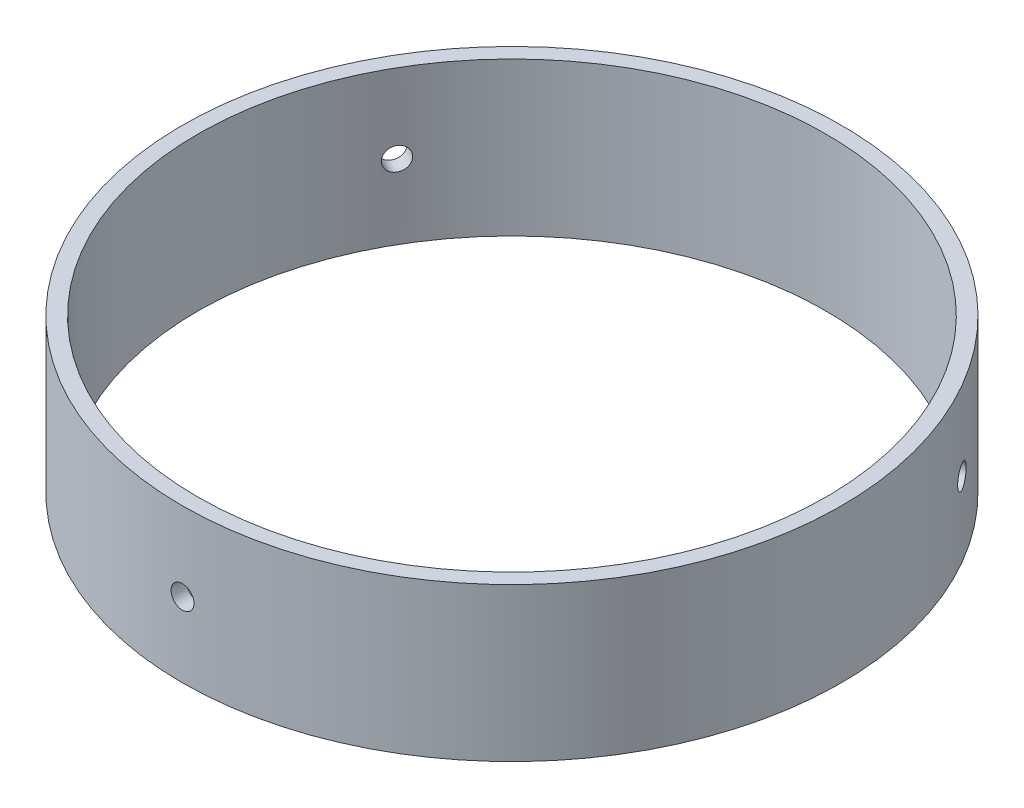
ISO-10303-21;
HEADER;
FILE_DESCRIPTION(('STEP AP214'),'2;1');
FILE_NAME('part.step','',(''),(''),'','','');
FILE_SCHEMA(('AUTOMOTIVE_DESIGN { 1 0 10303 214 1 1 1 1 }'));
ENDSEC;
DATA;
#1=APPLICATION_CONTEXT('core data for automotive mechanical design processes');
#2=APPLICATION_PROTOCOL_DEFINITION('international standard','automotive_design',2000,#1);
#3=PRODUCT_CONTEXT('',#1,'mechanical');
#4=PRODUCT('Part','Part','',(#3));
#5=PRODUCT_RELATED_PRODUCT_CATEGORY('part','',(#4));
#6=PRODUCT_DEFINITION_FORMATION('','',#4);
#7=PRODUCT_DEFINITION_CONTEXT('part definition',#1,'design');
#8=PRODUCT_DEFINITION('design','',#6,#7);
#9=PRODUCT_DEFINITION_SHAPE('','',#8);
#10=(LENGTH_UNIT() NAMED_UNIT(*) SI_UNIT(.MILLI.,.METRE.));
#11=(NAMED_UNIT(*) PLANE_ANGLE_UNIT() SI_UNIT($,.RADIAN.));
#12=(NAMED_UNIT(*) SI_UNIT($,.STERADIAN.) SOLID_ANGLE_UNIT());
#13=UNCERTAINTY_MEASURE_WITH_UNIT(LENGTH_MEASURE(1.E-05),#10,'distance_accuracy_value','');
#14=(GEOMETRIC_REPRESENTATION_CONTEXT(3) GLOBAL_UNCERTAINTY_ASSIGNED_CONTEXT((#13)) GLOBAL_UNIT_ASSIGNED_CONTEXT((#10,
#11,#12)) REPRESENTATION_CONTEXT('',''));
#15=CARTESIAN_POINT('',(0.,0.,0.));
#16=DIRECTION('',(0.,0.,1.));
#17=DIRECTION('',(1.,0.,0.));
#18=AXIS2_PLACEMENT_3D('',#15,#16,#17);
#19=CARTESIAN_POINT('',(0.,25.4,0.));
#20=DIRECTION('',(0.,-1.,0.));
#21=DIRECTION('',(0.,0.,-1.));
#22=AXIS2_PLACEMENT_3D('',#19,#20,#21);
#23=CYLINDRICAL_SURFACE('',#22,54.61);
#24=CARTESIAN_POINT('',(0.,25.4,0.));
#25=DIRECTION('',(0.,1.,0.));
#26=DIRECTION('',(0.,0.,1.));
#27=AXIS2_PLACEMENT_3D('',#24,#25,#26);
#28=CIRCLE('',#27,54.61);
#29=CARTESIAN_POINT('',(0.,25.4,54.61));
#30=VERTEX_POINT('',#29);
#31=EDGE_CURVE('E10',#30,#30,#28,.T.);
#32=ORIENTED_EDGE('',*,*,#31,.F.);
#33=EDGE_LOOP('',(#32));
#34=FACE_BOUND('',#33,.T.);
#35=CARTESIAN_POINT('',(0.,0.,0.));
#36=DIRECTION('',(0.,1.,0.));
#37=DIRECTION('',(0.,0.,1.));
#38=AXIS2_PLACEMENT_3D('',#35,#36,#37);
#39=CIRCLE('',#38,54.61);
#40=CARTESIAN_POINT('',(0.,0.,54.61));
#41=VERTEX_POINT('',#40);
#42=EDGE_CURVE('E44',#41,#41,#39,.T.);
#43=ORIENTED_EDGE('',*,*,#42,.T.);
#44=EDGE_LOOP('',(#43));
#45=FACE_BOUND('',#44,.T.);
#46=CARTESIAN_POINT('',(0.,10.4239555269859,54.61));
#47=CARTESIAN_POINT('',(0.106969775627343,10.4239602599121,54.6099995529571));
#48=CARTESIAN_POINT('',(0.214016285777394,10.4329956416153,54.6096823316829));
#49=CARTESIAN_POINT('',(0.425158795307455,10.4689128482885,54.608447368905));
#50=CARTESIAN_POINT('',(0.52925112556797,10.4958159334483,54.6075289120296));
#51=CARTESIAN_POINT('',(0.731395950473661,10.5666995988189,54.6051954791821));
#52=CARTESIAN_POINT('',(0.829451396653879,10.6106717556031,54.6037807481497));
#53=CARTESIAN_POINT('',(1.01676171214993,10.7144330998902,54.6006142968803));
#54=CARTESIAN_POINT('',(1.10601870854792,10.7742184515143,54.5988626583965));
#55=CARTESIAN_POINT('',(1.27327623468102,10.9079480611374,54.595218479672));
#56=CARTESIAN_POINT('',(1.35127129184676,10.981899162431,54.5933258716019));
#57=CARTESIAN_POINT('',(1.49374470053449,11.1418485181315,54.5896136565972));
#58=CARTESIAN_POINT('',(1.55822251103852,11.2278472545065,54.5877940525868));
#59=CARTESIAN_POINT('',(1.67184201742921,11.4094739988082,54.5844326497573));
#60=CARTESIAN_POINT('',(1.72098007826895,11.5051042820239,54.5828909168215));
#61=CARTESIAN_POINT('',(1.80250171780979,11.7032633842901,54.580259807431));
#62=CARTESIAN_POINT('',(1.83488537555516,11.8057921707921,54.5791704288421));
#63=CARTESIAN_POINT('',(1.88196623483984,12.0147933143339,54.5775674030549));
#64=CARTESIAN_POINT('',(1.89667068923612,12.1212640357115,54.5770535197666));
#65=CARTESIAN_POINT('',(1.90799809069456,12.3351638303227,54.5766587189544));
#66=CARTESIAN_POINT('',(1.90462112389026,12.4425928989887,54.5767777984151));
#67=CARTESIAN_POINT('',(1.87988764209952,12.6553106574942,54.577635275006));
#68=CARTESIAN_POINT('',(1.85853896320751,12.7606002597038,54.5783734022162));
#69=CARTESIAN_POINT('',(1.79848019551148,12.9661002369379,54.5803853434239));
#70=CARTESIAN_POINT('',(1.75977006150685,13.0663105987378,54.5816591588161));
#71=CARTESIAN_POINT('',(1.66607823603268,13.2588327254405,54.5845991971315));
#72=CARTESIAN_POINT('',(1.6110929564523,13.3511427427972,54.5862655065696));
#73=CARTESIAN_POINT('',(1.48641432024243,13.5252246823535,54.5898026067403));
#74=CARTESIAN_POINT('',(1.4167209160937,13.606996570505,54.5916733981335));
#75=CARTESIAN_POINT('',(1.26456006729128,13.7577266844407,54.5954097769148));
#76=CARTESIAN_POINT('',(1.18208583036259,13.8266780537461,54.5972753609957));
#77=CARTESIAN_POINT('',(1.00672840008933,13.9497570524933,54.6007900626657));
#78=CARTESIAN_POINT('',(0.913845204914098,14.003884679328,54.6024391802168));
#79=CARTESIAN_POINT('',(0.720302624519637,14.0957789618525,54.6053350891605));
#80=CARTESIAN_POINT('',(0.61964313459512,14.1335453971989,54.6065818751347));
#81=CARTESIAN_POINT('',(0.4134070526955,14.1916408455937,54.6085324969699));
#82=CARTESIAN_POINT('',(0.307830478743623,14.2119699225522,54.609236334821));
#83=CARTESIAN_POINT('',(0.0948167356045886,14.2346051735236,54.610021469043));
#84=CARTESIAN_POINT('',(-0.0126194243657498,14.2369208341309,54.6101030930966));
#85=CARTESIAN_POINT('',(-0.226354938776963,14.2234882479484,54.6096354675401));
#86=CARTESIAN_POINT('',(-0.332654295017761,14.2077400297638,54.6090862189291));
#87=CARTESIAN_POINT('',(-0.541072271659497,14.1586345722743,54.6074189526073));
#88=CARTESIAN_POINT('',(-0.643191909265567,14.1252816451613,54.606301074182));
#89=CARTESIAN_POINT('',(-0.840382893964743,14.0419179126559,54.6036224941728));
#90=CARTESIAN_POINT('',(-0.935454221633547,13.9919070613582,54.6020617913684));
#91=CARTESIAN_POINT('',(-1.11589350123285,13.876622705868,54.5986725126272));
#92=CARTESIAN_POINT('',(-1.20125737498798,13.8113428219848,54.5968438248408));
#93=CARTESIAN_POINT('',(-1.35981760983991,13.6673828168347,54.5931250135553));
#94=CARTESIAN_POINT('',(-1.43301393058506,13.5887026511297,54.5912348898524));
#95=CARTESIAN_POINT('',(-1.56519301489747,13.4201348402539,54.5876053454446));
#96=CARTESIAN_POINT('',(-1.62416965425449,13.3302423913148,54.5858659898791));
#97=CARTESIAN_POINT('',(-1.72619338466828,13.1418261826704,54.5827351164865));
#98=CARTESIAN_POINT('',(-1.76924051827669,13.0433024460222,54.5813435977301));
#99=CARTESIAN_POINT('',(-1.83817256143816,12.8404433737013,54.5790657587231));
#100=CARTESIAN_POINT('',(-1.86406142183157,12.7361093818919,54.5781793221794));
#101=CARTESIAN_POINT('',(-1.89795497261171,12.524572480879,54.5770112674852));
#102=CARTESIAN_POINT('',(-1.90595969567723,12.417369576918,54.5767296482294));
#103=CARTESIAN_POINT('',(-1.9038573014907,12.2031991246086,54.5768030222639));
#104=CARTESIAN_POINT('',(-1.89375983430056,12.0962314812794,54.5771576763645));
#105=CARTESIAN_POINT('',(-1.85575956396343,11.8855107461099,54.5784629040581));
#106=CARTESIAN_POINT('',(-1.82785672574385,11.7817576606022,54.579413478825));
#107=CARTESIAN_POINT('',(-1.75503933669187,11.5804081229601,54.58180333285));
#108=CARTESIAN_POINT('',(-1.7101245230023,11.4828117659826,54.5832426196594));
#109=CARTESIAN_POINT('',(-1.6045608055315,11.2965463414836,54.5864475932976));
#110=CARTESIAN_POINT('',(-1.54391245361031,11.2078769609965,54.5882132686775));
#111=CARTESIAN_POINT('',(-1.40857232251474,11.0419365764004,54.5918729816849));
#112=CARTESIAN_POINT('',(-1.33387456925283,10.9646704462181,54.5937670736977));
#113=CARTESIAN_POINT('',(-1.17254589656414,10.8237534674585,54.5974700126265));
#114=CARTESIAN_POINT('',(-1.08591203075166,10.7601059905303,54.5992788383464));
#115=CARTESIAN_POINT('',(-0.903129764902133,10.6482185131034,54.6026081084077));
#116=CARTESIAN_POINT('',(-0.806974662675166,10.5999894683916,54.6041283473794));
#117=CARTESIAN_POINT('',(-0.608000477464156,10.5204160522017,54.6067055723962));
#118=CARTESIAN_POINT('',(-0.505189490476256,10.4890515840214,54.6077631095393));
#119=CARTESIAN_POINT('',(-0.334775953220498,10.4523927368054,54.6090137044382));
#120=CARTESIAN_POINT('',(-0.268279082846069,10.4417422400079,54.6093819563875));
#121=CARTESIAN_POINT('',(-0.134531593647159,10.4275221480815,54.6098752447082));
#122=CARTESIAN_POINT('',(-0.0672809751254226,10.4239525501087,54.6100002811774));
#123=CARTESIAN_POINT('',(0.,10.4239555269859,54.61));
#124=B_SPLINE_CURVE_WITH_KNOTS('',3,(#46,#47,#48,#49,#50,#51,#52,#53,#54,#55,#56,#57,#58,#59,
#60,#61,#62,#63,#64,#65,#66,#67,#68,#69,#70,#71,#72,#73,#74,#75,#76,#77,#78,#79,#80,#81,#82,#83,
#84,#85,#86,#87,#88,#89,#90,#91,#92,#93,#94,#95,#96,#97,#98,#99,#100,#101,#102,#103,#104,#105,
#106,#107,#108,#109,#110,#111,#112,#113,#114,#115,#116,#117,#118,#119,#120,#121,#122,#123),
.UNSPECIFIED.,.T.,.F.,(4,2,2,2,2,2,2,2,2,2,2,2,2,2,2,2,2,2,2,2,2,2,2,2,2,2,2,2,2,2,2,2,2,2,2,2,
2,2,4),(0.,0.320663739375775,0.641709711141668,0.962597450739142,1.28340742240517,
1.60437276595062,1.92535095344858,2.2464051452273,2.5674578223161,2.88837874321022,
3.2092981353511,3.53007767142806,3.85085804266061,4.17170918769463,4.49256136935549,
4.81358465392159,5.13460799494749,5.45563565920209,5.77666214684486,6.09751955748752,
6.41837646003512,6.73915480661652,7.05993403719196,7.38084753556984,7.70176209818219,
8.02281462813049,8.34386630046197,8.66484402217062,8.98582115737217,9.30662723436537,
9.62743394327668,9.94824560927158,10.2690460241921,10.5899831595582,10.9109996594955,
11.2322437578877,11.5531041919902,11.7547927307502,11.9564811885042),.UNSPECIFIED.);
#125=CARTESIAN_POINT('',(0.,10.4239555269859,54.61));
#126=VERTEX_POINT('',#125);
#127=EDGE_CURVE('E61',#126,#126,#124,.T.);
#128=ORIENTED_EDGE('',*,*,#127,.F.);
#129=EDGE_LOOP('',(#128));
#130=FACE_BOUND('',#129,.T.);
#131=CARTESIAN_POINT('',(-46.3123633368386,12.3289555269859,-28.9381599649434));
#132=CARTESIAN_POINT('',(-46.3123660913571,12.2219857736902,-28.9381560901295));
#133=CARTESIAN_POINT('',(-46.3171586737822,12.1149392857948,-28.9304899329744));
#134=CARTESIAN_POINT('',(-46.3361873915337,11.903796822506,-28.9000025686463));
#135=CARTESIAN_POINT('',(-46.3504347768465,11.7997045162496,-28.8771633074162));
#136=CARTESIAN_POINT('',(-46.3878983630238,11.5975597420818,-28.8169435532089));
#137=CARTESIAN_POINT('',(-46.4111101397108,11.4995043224321,-28.7795702331323));
#138=CARTESIAN_POINT('',(-46.465733894339,11.3121940513111,-28.6912940572423));
#139=CARTESIAN_POINT('',(-46.4971438836076,11.2229370727913,-28.6403944824913));
#140=CARTESIAN_POINT('',(-46.5671650456343,11.0556795261527,-28.5264036044287));
#141=CARTESIAN_POINT('',(-46.6057797022843,10.9776844363421,-28.4633064022923));
#142=CARTESIAN_POINT('',(-46.6889690422995,10.8352109647398,-28.3266421510839));
#143=CARTESIAN_POINT('',(-46.733543964059,10.770733123866,-28.2530746832223));
#144=CARTESIAN_POINT('',(-46.8272676316227,10.6571135859649,-28.0974615480495));
#145=CARTESIAN_POINT('',(-46.8764174562864,10.6079755183377,-28.0154138804205));
#146=CARTESIAN_POINT('',(-46.9777746240633,10.5264538644789,-27.8451180625097));
#147=CARTESIAN_POINT('',(-47.0299819527656,10.4940701992857,-27.7568699414522));
#148=CARTESIAN_POINT('',(-47.1358700127583,10.4469893240714,-27.5766707333841));
#149=CARTESIAN_POINT('',(-47.189550130544,10.4322848606674,-27.4847211810018));
#150=CARTESIAN_POINT('',(-47.2968417154731,10.4209574362557,-27.2996758305652));
#151=CARTESIAN_POINT('',(-47.350453182942,10.4243343892091,-27.2065800379672));
#152=CARTESIAN_POINT('',(-47.4560699366224,10.4490678493385,-27.0219325175027));
#153=CARTESIAN_POINT('',(-47.5080759114141,10.4704165343554,-26.9303801355504));
#154=CARTESIAN_POINT('',(-47.6090844714665,10.5304753399644,-26.7514063538986));
#155=CARTESIAN_POINT('',(-47.658087048931,10.5691855056209,-26.6639849649222));
#156=CARTESIAN_POINT('',(-47.751802960256,10.6628773960766,-26.4957863705539));
#157=CARTESIAN_POINT('',(-47.796515347378,10.7178627015099,-26.4150106322502));
#158=CARTESIAN_POINT('',(-47.8804937092033,10.8425413926011,-26.2624830248397));
#159=CARTESIAN_POINT('',(-47.9197596663034,10.912234825795,-26.1907311848989));
#160=CARTESIAN_POINT('',(-47.9918888889853,11.0643956948733,-26.0583269063547));
#161=CARTESIAN_POINT('',(-48.0247487319519,11.1468699171875,-25.9976804020793));
#162=CARTESIAN_POINT('',(-48.0832437511496,11.3222273060587,-25.8893332032505));
#163=CARTESIAN_POINT('',(-48.1088789260766,11.4151104744946,-25.8416325110341));
#164=CARTESIAN_POINT('',(-48.1523171628703,11.608653048347,-25.7606012344697));
#165=CARTESIAN_POINT('',(-48.1701201150402,11.7093125626544,-25.7272708513901));
#166=CARTESIAN_POINT('',(-48.1974776703859,11.9155486974469,-25.6759829082973));
#167=CARTESIAN_POINT('',(-48.2070323038607,12.0211252998681,-25.6580252918143));
#168=CARTESIAN_POINT('',(-48.21766956438,12.2341390551277,-25.6380298159411));
#169=CARTESIAN_POINT('',(-48.2187566544276,12.3415751979225,-25.6359835701175));
#170=CARTESIAN_POINT('',(-48.2124455704041,12.5553106744224,-25.6478505054612));
#171=CARTESIAN_POINT('',(-48.205047409769,12.6616100099274,-25.6617636613574));
#172=CARTESIAN_POINT('',(-48.1819393635332,12.8700278890938,-25.7051243188035));
#173=CARTESIAN_POINT('',(-48.1662315174368,12.9721474520031,-25.7345680085804));
#174=CARTESIAN_POINT('',(-48.1268703840616,13.1693382965146,-25.8081029175792));
#175=CARTESIAN_POINT('',(-48.1032170748293,13.2644095586412,-25.8521941772726));
#176=CARTESIAN_POINT('',(-48.0485108805233,13.4448487953177,-25.9537283720832));
#177=CARTESIAN_POINT('',(-48.0174548967366,13.5302126842602,-26.0111768982201));
#178=CARTESIAN_POINT('',(-47.9486956726979,13.6887729539363,-26.1377094263594));
#179=CARTESIAN_POINT('',(-47.9109924104376,13.7619692943828,-26.2067934668859));
#180=CARTESIAN_POINT('',(-47.8298513229897,13.8941484188016,-26.3545919905116));
#181=CARTESIAN_POINT('',(-47.7864110393656,13.9531250785476,-26.4333106011651));
#182=CARTESIAN_POINT('',(-47.6949134386751,14.0551488447892,-26.5980487621689));
#183=CARTESIAN_POINT('',(-47.6468561339423,14.0981959938366,-26.6840682930159));
#184=CARTESIAN_POINT('',(-47.5473983190996,14.1671280477679,-26.8608877638713));
#185=CARTESIAN_POINT('',(-47.4959985829182,14.1930169101651,-26.9516865963278));
#186=CARTESIAN_POINT('',(-47.3912411432713,14.2269104745093,-27.1354665654455));
#187=CARTESIAN_POINT('',(-47.3378834433675,14.2349152089862,-27.228447698137));
#188=CARTESIAN_POINT('',(-47.2307347022331,14.2328128470289,-27.413888105106));
#189=CARTESIAN_POINT('',(-47.1769439067305,14.2227153871055,-27.5063476307729));
#190=CARTESIAN_POINT('',(-47.0704537692282,14.1847151127926,-27.6881849907666));
#191=CARTESIAN_POINT('',(-47.0177544293729,14.1568122634248,-27.777562819039));
#192=CARTESIAN_POINT('',(-46.9150108998429,14.0839948327912,-27.9507423553223));
#193=CARTESIAN_POINT('',(-46.8649667512001,14.0390799887192,-28.0345439771668));
#194=CARTESIAN_POINT('',(-46.7690592712337,13.9335161948645,-28.1942526561914));
#195=CARTESIAN_POINT('',(-46.7231957933335,13.8728677969964,-28.2701599901631));
#196=CARTESIAN_POINT('',(-46.6370565859178,13.7375276165402,-28.4120389412052));
#197=CARTESIAN_POINT('',(-46.5967832419654,13.6628298702866,-28.478006317467));
#198=CARTESIAN_POINT('',(-46.523117685507,13.5015012256606,-28.5981923231773));
#199=CARTESIAN_POINT('',(-46.4897271771445,13.4148673808282,-28.6524080431662));
#200=CARTESIAN_POINT('',(-46.4308994255775,13.2320851308644,-28.7476403172151));
#201=CARTESIAN_POINT('',(-46.4054678411262,13.1359300198159,-28.7886474806635));
#202=CARTESIAN_POINT('',(-46.3634482161624,12.9369558156681,-28.8562708869922));
#203=CARTESIAN_POINT('',(-46.3468496499529,12.8341448186132,-28.8829042586646));
#204=CARTESIAN_POINT('',(-46.3274365911964,12.6637313045444,-28.9140260855593));
#205=CARTESIAN_POINT('',(-46.3217922458428,12.5972344691983,-28.923065442606));
#206=CARTESIAN_POINT('',(-46.3142547531617,12.4634870502329,-28.9351335996626));
#207=CARTESIAN_POINT('',(-46.3123616043245,12.3962364669169,-28.9381624020914));
#208=CARTESIAN_POINT('',(-46.3123633368386,12.3289555269859,-28.9381599649434));
#209=B_SPLINE_CURVE_WITH_KNOTS('',3,(#131,#132,#133,#134,#135,#136,#137,#138,#139,#140,#141,
#142,#143,#144,#145,#146,#147,#148,#149,#150,#151,#152,#153,#154,#155,#156,#157,#158,#159,#160,
#161,#162,#163,#164,#165,#166,#167,#168,#169,#170,#171,#172,#173,#174,#175,#176,#177,#178,#179,
#180,#181,#182,#183,#184,#185,#186,#187,#188,#189,#190,#191,#192,#193,#194,#195,#196,#197,#198,
#199,#200,#201,#202,#203,#204,#205,#206,#207,#208),.UNSPECIFIED.,.T.,.F.,(4,2,2,2,2,2,2,2,2,2,2,
2,2,2,2,2,2,2,2,2,2,2,2,2,2,2,2,2,2,2,2,2,2,2,2,2,2,2,4),(0.,0.320663672311053,
0.641709578470521,0.962597241570786,1.28340713791716,1.60437256918643,1.92535084203685,
2.24640500109444,2.56745764704523,2.88837852724624,3.20929788037462,3.53007762619839,
3.85085820466087,4.17170940941121,4.49256165115145,4.81358484866018,5.1346081041184,
5.45563585563298,5.77666242788988,6.09751978464255,6.41837663333155,6.73915476838645,
7.05993378976597,7.38084732376297,7.70176192029451,8.02281448454551,8.3438661911781,
8.66484382229494,8.98582086957744,9.30662709887284,9.62743395838526,9.94824577401527,
10.2690463374644,10.5899833828842,10.9109997949524,11.232243932178,11.5531044028918,
11.7547928362377,11.9564811884128),.UNSPECIFIED.);
#210=CARTESIAN_POINT('',(-46.3123633368386,12.3289555269859,-28.9381599649434));
#211=VERTEX_POINT('',#210);
#212=EDGE_CURVE('E106',#211,#211,#209,.T.);
#213=ORIENTED_EDGE('',*,*,#212,.F.);
#214=EDGE_LOOP('',(#213));
#215=FACE_BOUND('',#214,.T.);
#216=CARTESIAN_POINT('',(48.2173633368382,12.3289555269859,-25.6386031765253));
#217=CARTESIAN_POINT('',(48.2173613584102,12.2219857736902,-25.6386074994153));
#218=CARTESIAN_POINT('',(48.2131185627771,12.1149392857948,-25.6465910761227));
#219=CARTESIAN_POINT('',(48.1962300896502,11.903796822506,-25.6783141112611));
#220=CARTESIAN_POINT('',(48.1835744018777,11.7997045162496,-25.7020723394945));
#221=CARTESIAN_POINT('',(48.1501543580131,11.5975597420818,-25.7646266339445));
#222=CARTESIAN_POINT('',(48.1293940017465,11.4995043224321,-25.8034152822607));
#223=CARTESIAN_POINT('',(48.0802564681909,11.3121940513111,-25.8948589293638));
#224=CARTESIAN_POINT('',(48.051881138049,11.2229370727913,-25.9475105653786));
#225=CARTESIAN_POINT('',(47.9881727228606,11.0556795261527,-26.0651461095275));
#226=CARTESIAN_POINT('',(47.9528362712277,10.9776844363421,-26.130135984213));
#227=CARTESIAN_POINT('',(47.8760762278996,10.8352109647398,-26.2705121915944));
#228=CARTESIAN_POINT('',(47.8346523927191,10.770733123866,-26.3458989401406));
#229=CARTESIAN_POINT('',(47.7467492982788,10.6571135859649,-26.5048725847731));
#230=CARTESIAN_POINT('',(47.7002688461227,10.6079755183377,-26.5884614153379));
#231=CARTESIAN_POINT('',(47.6034669255422,10.5264538644789,-26.7613872064437));
#232=CARTESIAN_POINT('',(47.5531454752212,10.4940701992857,-26.8507241398924));
#233=CARTESIAN_POINT('',(47.4500324132887,10.4469893240714,-27.0325254938375));
#234=CARTESIAN_POINT('',(47.3972418239519,10.4322848606674,-27.1249886157092));
#235=CARTESIAN_POINT('',(47.2906336420861,10.4209574362557,-27.3104285290885));
#236=CARTESIAN_POINT('',(47.2368160544453,10.4243343892091,-27.4034053181497));
#237=CARTESIAN_POINT('',(47.1297149878174,10.4490678493385,-27.5871958701344));
#238=CARTESIAN_POINT('',(47.0764312866656,10.4704165343554,-27.6780105564287));
#239=CARTESIAN_POINT('',(46.9719397251699,10.5304753399644,-27.8549734262597));
#240=CARTESIAN_POINT('',(46.9207318702146,10.5691855056209,-27.941121597683));
#241=CARTESIAN_POINT('',(46.8219255702733,10.6628773960766,-28.1063812548135));
#242=CARTESIAN_POINT('',(46.7743279224538,10.7178627015099,-28.1854911870768));
#243=CARTESIAN_POINT('',(46.6842243205706,10.8425413926011,-28.334482385491));
#244=CARTESIAN_POINT('',(46.6417183829636,10.912234825795,-28.404363621814));
#245=CARTESIAN_POINT('',(46.5631175255155,11.0643956948733,-28.5330315002838));
#246=CARTESIAN_POINT('',(46.5270260336455,11.1468699171875,-28.591812211195));
#247=CARTESIAN_POINT('',(46.4624421166299,11.3222273060587,-28.6966439832295));
#248=CARTESIAN_POINT('',(46.4339496928558,11.4151104744946,-28.7426950420549));
#249=CARTESIAN_POINT('',(46.3854936672468,11.608653048347,-28.820829296896));
#250=CARTESIAN_POINT('',(46.365530184867,11.7093125626544,-28.8529122972773));
#251=CARTESIAN_POINT('',(46.3347923009136,11.9155486974469,-28.9022486067385));
#252=CARTESIAN_POINT('',(46.3240178655853,12.0211252998681,-28.9195019702931));
#253=CARTESIAN_POINT('',(46.312019905778,12.2341390551277,-28.938711846066));
#254=CARTESIAN_POINT('',(46.3107913499362,12.3415751979225,-28.9406764165753));
#255=CARTESIAN_POINT('',(46.3179128753971,12.5553106744224,-28.9292773898137));
#256=CARTESIAN_POINT('',(46.3262629415325,12.6616100099274,-28.9159138168143));
#257=CARTESIAN_POINT('',(46.3522603492877,12.8700278890938,-28.8742213330192));
#258=CARTESIAN_POINT('',(46.3699054095675,12.9721474520031,-28.8458960943725));
#259=CARTESIAN_POINT('',(46.4139079421378,13.1693382965146,-28.7750408984485));
#260=CARTESIAN_POINT('',(46.440265438501,13.2644095586412,-28.732510901923));
#261=CARTESIAN_POINT('',(46.5008435334068,13.4448487953177,-28.6343668505044));
#262=CARTESIAN_POINT('',(46.5350674245579,13.5302126842602,-28.5787473165371));
#263=CARTESIAN_POINT('',(46.6102681963124,13.6887729539363,-28.4559338177055));
#264=CARTESIAN_POINT('',(46.6512450992742,13.7619692943828,-28.3887398145192));
#265=CARTESIAN_POINT('',(46.7386718316519,13.8941484188016,-28.2445703096858));
#266=CARTESIAN_POINT('',(46.7851240064164,13.9531250785476,-28.167590615193));
#267=CARTESIAN_POINT('',(46.8820426384732,14.0551488447892,-28.0059822881078));
#268=CARTESIAN_POINT('',(46.9325090850419,14.0981959938366,-27.9213536759482));
#269=CARTESIAN_POINT('',(47.0359103312651,14.1671280477679,-27.7468109462619));
#270=CARTESIAN_POINT('',(47.0888445587156,14.1930169101651,-27.6568980527527));
#271=CARTESIAN_POINT('',(47.1956239608549,14.2269104745093,-27.4742854642243));
#272=CARTESIAN_POINT('',(47.2494691338865,14.2349152089862,-27.3815857742743));
#273=CARTESIAN_POINT('',(47.3564908666426,14.2328128470289,-27.1960720389839));
#274=CARTESIAN_POINT('',(47.4096677669407,14.2227153871055,-27.1032580807554));
#275=CARTESIAN_POINT('',(47.5138984713011,14.1847151127926,-26.9201162364291));
#276=CARTESIAN_POINT('',(47.5649522711924,14.1568122634248,-26.8297883552155));
#277=CARTESIAN_POINT('',(47.6635583842644,14.0839948327912,-26.6542200804265));
#278=CARTESIAN_POINT('',(47.7111106433386,14.0390799887192,-26.5689797654687));
#279=CARTESIAN_POINT('',(47.8014686765956,13.9335161948645,-26.4060671118926));
#280=CARTESIAN_POINT('',(47.8442746171986,13.8728677969964,-26.3283945079392));
#281=CARTESIAN_POINT('',(47.9240757893554,13.7375276165402,-26.1828562905343));
#282=CARTESIAN_POINT('',(47.9610685410429,13.6628298702866,-26.1149948634453));
#283=CARTESIAN_POINT('',(48.0283198969383,13.5015012256606,-25.9911056173132));
#284=CARTESIAN_POINT('',(48.0585768335518,13.4148673808282,-25.9350807288316));
#285=CARTESIAN_POINT('',(48.1116365263548,13.2320851308644,-25.8365182645026));
#286=CARTESIAN_POINT('',(48.1344339794127,13.1359300198159,-25.7939902845851));
#287=CARTESIAN_POINT('',(48.1719877547019,12.9369558156681,-25.7237885187446));
#288=CARTESIAN_POINT('',(48.1867536480539,12.8341448186132,-25.6960970529046));
#289=CARTESIAN_POINT('',(48.2039994113786,12.6637313045444,-25.663723937409));
#290=CARTESIAN_POINT('',(48.2090055515381,12.5972344691983,-25.6543161124217));
#291=CARTESIAN_POINT('',(48.2156881357854,12.4634870502329,-25.6417543737507));
#292=CARTESIAN_POINT('',(48.2173645812132,12.3962364669169,-25.6386004575502));
#293=CARTESIAN_POINT('',(48.2173633368382,12.3289555269859,-25.6386031765253));
#294=B_SPLINE_CURVE_WITH_KNOTS('',3,(#216,#217,#218,#219,#220,#221,#222,#223,#224,#225,#226,
#227,#228,#229,#230,#231,#232,#233,#234,#235,#236,#237,#238,#239,#240,#241,#242,#243,#244,#245,
#246,#247,#248,#249,#250,#251,#252,#253,#254,#255,#256,#257,#258,#259,#260,#261,#262,#263,#264,
#265,#266,#267,#268,#269,#270,#271,#272,#273,#274,#275,#276,#277,#278,#279,#280,#281,#282,#283,
#284,#285,#286,#287,#288,#289,#290,#291,#292,#293),.UNSPECIFIED.,.T.,.F.,(4,2,2,2,2,2,2,2,2,2,2,
2,2,2,2,2,2,2,2,2,2,2,2,2,2,2,2,2,2,2,2,2,2,2,2,2,2,2,4),(0.,0.320663672311051,
0.641709578470522,0.96259724157079,1.28340713791717,1.60437256918643,1.92535084203685,
2.24640500109443,2.56745764704523,2.88837852724625,3.20929788037462,3.53007762619839,
3.85085820466087,4.17170940941121,4.49256165115145,4.81358484866018,5.1346081041184,
5.45563585563298,5.77666242788988,6.09751978464255,6.41837663333155,6.73915476838644,
7.05993378976597,7.38084732376297,7.70176192029452,8.02281448454552,8.3438661911781,
8.66484382229494,8.98582086957743,9.30662709887284,9.62743395838525,9.94824577401527,
10.2690463374644,10.5899833828842,10.9109997949524,11.232243932178,11.5531044028918,
11.7547928362377,11.9564811884128),.UNSPECIFIED.);
#295=CARTESIAN_POINT('',(48.2173633368382,12.3289555269859,-25.6386031765253));
#296=VERTEX_POINT('',#295);
#297=EDGE_CURVE('E62',#296,#296,#294,.T.);
#298=ORIENTED_EDGE('',*,*,#297,.F.);
#299=EDGE_LOOP('',(#298));
#300=FACE_BOUND('',#299,.T.);
#301=ADVANCED_FACE('F31',(#34,#45,#130,#215,#300),#23,.T.);
#302=CARTESIAN_POINT('',(0.,25.4,0.));
#303=DIRECTION('',(0.,-1.,0.));
#304=DIRECTION('',(0.,0.,-1.));
#305=AXIS2_PLACEMENT_3D('',#302,#303,#304);
#306=CYLINDRICAL_SURFACE('',#305,52.07);
#307=CARTESIAN_POINT('',(-44.1112537967048,12.3289555269859,-27.6673487794313));
#308=CARTESIAN_POINT('',(-44.111256569404,12.2219892655447,-27.6673449165597));
#309=CARTESIAN_POINT('',(-44.1160622664923,12.1149463548565,-27.6596870095714));
#310=CARTESIAN_POINT('',(-44.1351419407184,11.9038111870525,-27.6292319168869));
#311=CARTESIAN_POINT('',(-44.1494271855984,11.7997225952704,-27.6064167146303));
#312=CARTESIAN_POINT('',(-44.1869866781689,11.5975852691021,-27.5462585214453));
#313=CARTESIAN_POINT('',(-44.210256477672,11.4995335737015,-27.5089227194936));
#314=CARTESIAN_POINT('',(-44.2650097147197,11.3122300130282,-27.4207311315299));
#315=CARTESIAN_POINT('',(-44.2964911653714,11.2229760262482,-27.3698786159686));
#316=CARTESIAN_POINT('',(-44.3666618910436,11.0557199379436,-27.2559842154955));
#317=CARTESIAN_POINT('',(-44.4053549258777,10.9777237435643,-27.1929359715971));
#318=CARTESIAN_POINT('',(-44.4886980360713,10.8352472611447,-27.0563676922132));
#319=CARTESIAN_POINT('',(-44.5333483501535,10.7707675150079,-26.9828472370726));
#320=CARTESIAN_POINT('',(-44.6272126278478,10.6571418544453,-26.8273187734695));
#321=CARTESIAN_POINT('',(-44.676427783833,10.607999961104,-26.7453085467575));
#322=CARTESIAN_POINT('',(-44.7778971482032,10.5264709474708,-26.575075463075));
#323=CARTESIAN_POINT('',(-44.8301513414425,10.4940837436864,-26.4868526370657));
#324=CARTESIAN_POINT('',(-44.9361071557007,10.4469974745115,-26.3066927584808));
#325=CARTESIAN_POINT('',(-44.9898081124259,10.432290428018,-26.2147574011875));
#326=CARTESIAN_POINT('',(-45.0971149544056,10.4209573464483,-26.0297245308868));
#327=CARTESIAN_POINT('',(-45.1507208401393,10.4243312199992,-25.9366270237547));
#328=CARTESIAN_POINT('',(-45.2562981476237,10.4490575188441,-25.7519647325086));
#329=CARTESIAN_POINT('',(-45.3082703392379,10.4704013401045,-25.6603992362604));
#330=CARTESIAN_POINT('',(-45.4091891516648,10.5304483409631,-25.4813854756348));
#331=CARTESIAN_POINT('',(-45.4581357641621,10.5691515682683,-25.3939372225731));
#332=CARTESIAN_POINT('',(-45.5517248684632,10.6628285944799,-25.2256722942531));
#333=CARTESIAN_POINT('',(-45.5963663153537,10.7178063302868,-25.1448572296514));
#334=CARTESIAN_POINT('',(-45.680194898879,10.8424688523771,-24.9922445305253));
#335=CARTESIAN_POINT('',(-45.7193820159037,10.912153691535,-24.9204469284216));
#336=CARTESIAN_POINT('',(-45.7913566656127,11.0643010061826,-24.7879457832868));
#337=CARTESIAN_POINT('',(-45.824140434341,11.1467709461129,-24.7272487666239));
#338=CARTESIAN_POINT('',(-45.8824927310212,11.3221211461268,-24.6188051129445));
#339=CARTESIAN_POINT('',(-45.9080612576227,11.4150014081587,-24.5710584783516));
#340=CARTESIAN_POINT('',(-45.9513833951887,11.6085400448021,-24.4899446511954));
#341=CARTESIAN_POINT('',(-45.969136884343,11.7091985406211,-24.4565776827625));
#342=CARTESIAN_POINT('',(-45.9964183871246,11.9154343596281,-24.4052299345077));
#343=CARTESIAN_POINT('',(-46.0059464339586,12.0210116629565,-24.3872490925704));
#344=CARTESIAN_POINT('',(-46.016556307338,12.2340225705945,-24.3672234122651));
#345=CARTESIAN_POINT('',(-46.0176430275751,12.3414550631815,-24.3651693406691));
#346=CARTESIAN_POINT('',(-46.0113584339953,12.5551843306548,-24.377035061719));
#347=CARTESIAN_POINT('',(-46.0039871349507,12.6614811075243,-24.3909548264661));
#348=CARTESIAN_POINT('',(-45.9809576931636,12.8698923715448,-24.4343411272936));
#349=CARTESIAN_POINT('',(-45.9653017884485,12.972007980186,-24.4638034646519));
#350=CARTESIAN_POINT('',(-45.9260641830222,13.1691926843952,-24.5373848873865));
#351=CARTESIAN_POINT('',(-45.9024824581307,13.2642617584644,-24.5815040174781));
#352=CARTESIAN_POINT('',(-45.8479303902302,13.4447028167908,-24.68310135133));
#353=CARTESIAN_POINT('',(-45.8169566447629,13.5300703087363,-24.7405857066279));
#354=CARTESIAN_POINT('',(-45.7483644252707,13.6886397898603,-24.8671916811056));
#355=CARTESIAN_POINT('',(-45.7107459273097,13.7618417352136,-24.936313342206));
#356=CARTESIAN_POINT('',(-45.6297658461089,13.8940371079189,-25.0841875445178));
#357=CARTESIAN_POINT('',(-45.5864015548682,13.9530237984203,-25.1629446255668));
#358=CARTESIAN_POINT('',(-45.4950401412156,14.0550681962755,-25.327753315409));
#359=CARTESIAN_POINT('',(-45.4470430319224,14.0981259487335,-25.4138049035464));
#360=CARTESIAN_POINT('',(-45.3476842233073,14.1670784050759,-25.5906762981423));
#361=CARTESIAN_POINT('',(-45.2963233801982,14.1929774580612,-25.681494890037));
#362=CARTESIAN_POINT('',(-45.191617185561,14.2268915915084,-25.8653014426946));
#363=CARTESIAN_POINT('',(-45.1382718383615,14.2349067109761,-25.9582893987257));
#364=CARTESIAN_POINT('',(-45.031122911899,14.2328249694414,-26.1437244814992));
#365=CARTESIAN_POINT('',(-44.9773196190533,14.2227387045234,-26.2361718928832));
#366=CARTESIAN_POINT('',(-44.8707784318932,14.1847623392764,-26.4179720715571));
#367=CARTESIAN_POINT('',(-44.8180405396651,14.1568722040838,-26.5073248327866));
#368=CARTESIAN_POINT('',(-44.7151982234844,14.0840815873349,-26.6804440298112));
#369=CARTESIAN_POINT('',(-44.6650938387554,14.0391808525026,-26.7642103824066));
#370=CARTESIAN_POINT('',(-44.5690506906073,13.9336463349088,-26.9238427590341));
#371=CARTESIAN_POINT('',(-44.5231117828788,13.873013097468,-26.9997090567705));
#372=CARTESIAN_POINT('',(-44.4368122574406,13.7377000720801,-27.1415092039506));
#373=CARTESIAN_POINT('',(-44.3964543184109,13.6630135793539,-27.207438285216));
#374=CARTESIAN_POINT('',(-44.3226219755804,13.5017057782561,-27.3275514145125));
#375=CARTESIAN_POINT('',(-44.2891492756804,13.4150815244638,-27.3817325554415));
#376=CARTESIAN_POINT('',(-44.2301675551945,13.2323139409058,-27.4769053041733));
#377=CARTESIAN_POINT('',(-44.2046643888739,13.1361636814844,-27.5178872167523));
#378=CARTESIAN_POINT('',(-44.1625208617315,12.9371960488547,-27.5854717638321));
#379=CARTESIAN_POINT('',(-44.1458699599028,12.8343867694754,-27.6120915009374));
#380=CARTESIAN_POINT('',(-44.1263873290818,12.6639350379527,-27.6432094262731));
#381=CARTESIAN_POINT('',(-44.1207204668537,12.5973983445768,-27.6522508501616));
#382=CARTESIAN_POINT('',(-44.1131528289627,12.463569730275,-27.66432174101));
#383=CARTESIAN_POINT('',(-44.111252051627,12.3962778096846,-27.6673512106403));
#384=CARTESIAN_POINT('',(-44.1112537967048,12.3289555269859,-27.6673487794313));
#385=B_SPLINE_CURVE_WITH_KNOTS('',3,(#307,#308,#309,#310,#311,#312,#313,#314,#315,#316,#317,
#318,#319,#320,#321,#322,#323,#324,#325,#326,#327,#328,#329,#330,#331,#332,#333,#334,#335,#336,
#337,#338,#339,#340,#341,#342,#343,#344,#345,#346,#347,#348,#349,#350,#351,#352,#353,#354,#355,
#356,#357,#358,#359,#360,#361,#362,#363,#364,#365,#366,#367,#368,#369,#370,#371,#372,#373,#374,
#375,#376,#377,#378,#379,#380,#381,#382,#383,#384),.UNSPECIFIED.,.T.,.F.,(4,2,2,2,2,2,2,2,2,2,2,
2,2,2,2,2,2,2,2,2,2,2,2,2,2,2,2,2,2,2,2,2,2,2,2,2,2,2,4),(0.,0.320653044565312,
0.641687913578002,0.962564043952041,1.28336260696718,1.60432889096121,1.92530804072469,
2.24637127020162,2.56743289973083,2.88834954246614,3.20926456343227,3.5300260172059,
3.85078835249986,4.17162834561096,4.4924694922139,4.8134986687892,5.13452790544415,
5.45556214568054,5.7765950898667,6.09744190766939,6.41828816510273,6.73904779241612,
7.05980839832186,7.38071693220773,7.70162662211442,8.02268809880659,8.34374866638031,
8.66472782571348,8.98570628497119,9.30649691298319,9.62728816917164,9.94808420190656,
10.2688691166779,10.5898074671157,10.9108251453705,11.232078085674,11.5529476260584,
11.7547599004356,11.9565720851709),.UNSPECIFIED.);
#386=CARTESIAN_POINT('',(-44.1112537967048,12.3289555269859,-27.6673487794313));
#387=VERTEX_POINT('',#386);
#388=EDGE_CURVE('E63',#387,#387,#385,.T.);
#389=ORIENTED_EDGE('',*,*,#388,.T.);
#390=EDGE_LOOP('',(#389));
#391=FACE_BOUND('',#390,.T.);
#392=CARTESIAN_POINT('',(0.,0.,0.));
#393=DIRECTION('',(0.,1.,0.));
#394=DIRECTION('',(0.,0.,1.));
#395=AXIS2_PLACEMENT_3D('',#392,#393,#394);
#396=CIRCLE('',#395,52.07);
#397=CARTESIAN_POINT('',(0.,0.,52.07));
#398=VERTEX_POINT('',#397);
#399=EDGE_CURVE('E52',#398,#398,#396,.T.);
#400=ORIENTED_EDGE('',*,*,#399,.F.);
#401=EDGE_LOOP('',(#400));
#402=FACE_BOUND('',#401,.T.);
#403=CARTESIAN_POINT('',(0.,25.4,0.));
#404=DIRECTION('',(0.,1.,0.));
#405=DIRECTION('',(0.,0.,1.));
#406=AXIS2_PLACEMENT_3D('',#403,#404,#405);
#407=CIRCLE('',#406,52.07);
#408=CARTESIAN_POINT('',(0.,25.4,52.07));
#409=VERTEX_POINT('',#408);
#410=EDGE_CURVE('E49',#409,#409,#407,.T.);
#411=ORIENTED_EDGE('',*,*,#410,.T.);
#412=EDGE_LOOP('',(#411));
#413=FACE_BOUND('',#412,.T.);
#414=CARTESIAN_POINT('',(-1.905,12.3289555269859,52.0351407704447));
#415=CARTESIAN_POINT('',(-1.90499526830546,12.2219892655447,52.0351412402369));
#416=CARTESIAN_POINT('',(-1.89596047776962,12.1149463548565,52.0354741425041));
#417=CARTESIAN_POINT('',(-1.86004575671715,11.9038111870525,52.0367700787376));
#418=CARTESIAN_POINT('',(-1.83314458953048,11.7997225952704,52.0377338625746));
#419=CARTESIAN_POINT('',(-1.76226631970125,11.5975852691021,52.0401822407015));
#420=CARTESIAN_POINT('',(-1.71829766698883,11.4995335737015,52.0416665772362));
#421=CARTESIAN_POINT('',(-1.61454489288832,11.3122300130282,52.0449884774772));
#422=CARTESIAN_POINT('',(-1.55476459724002,11.2229760262482,52.0468259557089));
#423=CARTESIAN_POINT('',(-1.42104379024546,11.0557199379436,52.0506483865065));
#424=CARTESIAN_POINT('',(-1.34709589194841,10.9777237435643,52.0526334156731));
#425=CARTESIAN_POINT('',(-1.18715273755405,10.8352472611447,52.0565265266392));
#426=CARTESIAN_POINT('',(-1.10115699866338,10.7707675150079,52.0584346053511));
#427=CARTESIAN_POINT('',(-0.91953325932436,10.6571418544453,52.0619592225406));
#428=CARTESIAN_POINT('',(-0.823902741629071,10.607999961104,52.0635756845191));
#429=CARTESIAN_POINT('',(-0.625741884410336,10.5264709474708,52.0663341899283));
#430=CARTESIAN_POINT('',(-0.523211579273002,10.4940837436864,52.0674762357231));
#431=CARTESIAN_POINT('',(-0.314210640546689,10.4469974745115,52.0691567232569));
#432=CARTESIAN_POINT('',(-0.207741807262072,10.432290428018,52.0696954373418));
#433=CARTESIAN_POINT('',(0.00615477994340771,10.4209573464483,52.0701094533458));
#434=CARTESIAN_POINT('',(0.113582529015595,10.4243312199992,52.0699847586174));
#435=CARTESIAN_POINT('',(0.326293418097942,10.4490575188441,52.0690862433391));
#436=CARTESIAN_POINT('',(0.431577559766158,10.4704013401045,52.0683127334432));
#437=CARTESIAN_POINT('',(0.637067430308371,10.5304483409631,52.0662041084118));
#438=CARTESIAN_POINT('',(0.737273145225021,10.5691515682683,52.0648689917328));
#439=CARTESIAN_POINT('',(0.929789399866694,10.6628285944799,52.0617870694151));
#440=CARTESIAN_POINT('',(1.0220980222654,10.7178063302868,52.0600401641831));
#441=CARTESIAN_POINT('',(1.19617878841137,10.8424688523771,52.0563314975162));
#442=CARTESIAN_POINT('',(1.27795089427642,10.912153691535,52.0543697353088));
#443=CARTESIAN_POINT('',(1.42868757684808,11.0643010061826,52.0504510378179));
#444=CARTESIAN_POINT('',(1.49764461957624,11.1467709461129,52.0484941060369));
#445=CARTESIAN_POINT('',(1.62073572688196,11.3221211461268,52.0448068504914));
#446=CARTESIAN_POINT('',(1.67486978868543,11.4150014081587,52.0430765267693));
#447=CARTESIAN_POINT('',(1.76677749238383,11.6085400448021,52.0400376848695));
#448=CARTESIAN_POINT('',(1.80455087927111,11.7091985406211,52.0387291732666));
#449=CARTESIAN_POINT('',(1.86266008507773,11.9154343596281,52.0366817736014));
#450=CARTESIAN_POINT('',(1.88299597439383,12.0210116629565,52.0359428832394));
#451=CARTESIAN_POINT('',(1.90564365895596,12.2340225705945,52.0351184629643));
#452=CARTESIAN_POINT('',(1.90796589725788,12.3414550631815,52.0350325544984));
#453=CARTESIAN_POINT('',(1.89454758460457,12.5551843306548,52.0355227973308));
#454=CARTESIAN_POINT('',(1.87880706519658,12.6614811075243,52.0360989474728));
#455=CARTESIAN_POINT('',(1.82971870561021,12.8698923715448,52.037848016264));
#456=CARTESIAN_POINT('',(1.79637562064544,12.972007980186,52.0390207737407));
#457=CARTESIAN_POINT('',(1.71303343659757,13.1691926843952,52.0418307220251));
#458=CARTESIAN_POINT('',(1.66303428669963,13.2642617584644,52.0434679142498));
#459=CARTESIAN_POINT('',(1.54777238067686,13.4447028167908,52.0470231045449));
#460=CARTESIAN_POINT('',(1.48250259593506,13.5300703087363,52.0489412317688));
#461=CARTESIAN_POINT('',(1.33856249602039,13.6886397898603,52.0528416144255));
#462=CARTESIAN_POINT('',(1.25989213257514,13.7618417352136,52.0548238700893));
#463=CARTESIAN_POINT('',(1.0913392762083,13.8940371079189,52.0586301637248));
#464=CARTESIAN_POINT('',(1.00145149767171,13.9530237984203,52.0604541264177));
#465=CARTESIAN_POINT('',(0.813042278677641,14.0550681962755,52.06373716619));
#466=CARTESIAN_POINT('',(0.714520862667973,14.0981259487335,52.0651962443025));
#467=CARTESIAN_POINT('',(0.511666337437637,14.1670784050759,52.0675846892501));
#468=CARTESIAN_POINT('',(0.40733470816635,14.1929774580612,52.0685141903051));
#469=CARTESIAN_POINT('',(0.195800466864161,14.2268915915084,52.0697392421445));
#470=CARTESIAN_POINT('',(0.0885978610955468,14.2349067109761,52.0700347943116));
#471=CARTESIAN_POINT('',(-0.125568094570424,14.2328249694414,52.0699586433936));
#472=CARTESIAN_POINT('',(-0.232531547765919,14.2227387045234,52.069587330674));
#473=CARTESIAN_POINT('',(-0.443245714490134,14.1847623392764,52.0682200453809));
#474=CARTESIAN_POINT('',(-0.546996421727213,14.1568722040838,52.0672240715841));
#475=CARTESIAN_POINT('',(-0.748343202323639,14.0840815873349,52.0647196116998));
#476=CARTESIAN_POINT('',(-0.845939184018161,14.0391808525026,52.0632111179813));
#477=CARTESIAN_POINT('',(-1.03220645151803,13.9336463349088,52.0598515001394));
#478=CARTESIAN_POINT('',(-1.12087804651311,13.873013097468,52.0580003878925));
#479=CARTESIAN_POINT('',(-1.28683033895055,13.7377000720801,52.0541628801186));
#480=CARTESIAN_POINT('',(-1.3641055676894,13.6630135793539,52.0521764203072));
#481=CARTESIAN_POINT('',(-1.50504276040354,13.5017057782561,52.0482923004433));
#482=CARTESIAN_POINT('',(-1.56870135480403,13.4150815244638,52.0463946624612));
#483=CARTESIAN_POINT('',(-1.68061423319673,13.2323139409058,52.0429013685273));
#484=CARTESIAN_POINT('',(-1.72885719374613,13.1361636814844,52.0413059349062));
#485=CARTESIAN_POINT('',(-1.80845889199168,12.9371960488547,52.0386008433357));
#486=CARTESIAN_POINT('',(-1.83983771148121,12.8343867694754,52.0374906079088));
#487=CARTESIAN_POINT('',(-1.8765279407455,12.6639350379527,52.0361771173531));
#488=CARTESIAN_POINT('',(-1.88719147463338,12.5973983445768,52.0357901826481));
#489=CARTESIAN_POINT('',(-1.9014289916999,12.463569730275,52.0352718614121));
#490=CARTESIAN_POINT('',(-1.90500297802759,12.3962778096846,52.0351404747675));
#491=CARTESIAN_POINT('',(-1.905,12.3289555269859,52.0351407704447));
#492=B_SPLINE_CURVE_WITH_KNOTS('',3,(#414,#415,#416,#417,#418,#419,#420,#421,#422,#423,#424,
#425,#426,#427,#428,#429,#430,#431,#432,#433,#434,#435,#436,#437,#438,#439,#440,#441,#442,#443,
#444,#445,#446,#447,#448,#449,#450,#451,#452,#453,#454,#455,#456,#457,#458,#459,#460,#461,#462,
#463,#464,#465,#466,#467,#468,#469,#470,#471,#472,#473,#474,#475,#476,#477,#478,#479,#480,#481,
#482,#483,#484,#485,#486,#487,#488,#489,#490,#491),.UNSPECIFIED.,.T.,.F.,(4,2,2,2,2,2,2,2,2,2,2,
2,2,2,2,2,2,2,2,2,2,2,2,2,2,2,2,2,2,2,2,2,2,2,2,2,2,2,4),(0.,0.320653044565309,0.641687913578,
0.962564043952039,1.28336260696718,1.6043288909612,1.92530804072469,2.24637127020162,
2.56743289973083,2.88834954246614,3.20926456343227,3.5300260172059,3.85078835249985,
4.17162834561096,4.4924694922139,4.8134986687892,5.13452790544415,5.45556214568053,
5.7765950898667,6.09744190766938,6.41828816510273,6.73904779241612,7.05980839832186,
7.38071693220773,7.70162662211441,8.02268809880658,8.34374866638031,8.66472782571347,
8.98570628497118,9.30649691298319,9.62728816917163,9.94808420190655,10.2688691166779,
10.5898074671157,10.9108251453705,11.232078085674,11.5529476260584,11.7547599004356,
11.9565720851709),.UNSPECIFIED.);
#493=CARTESIAN_POINT('',(-1.905,12.3289555269859,52.0351407704447));
#494=VERTEX_POINT('',#493);
#495=EDGE_CURVE('E55',#494,#494,#492,.T.);
#496=ORIENTED_EDGE('',*,*,#495,.T.);
#497=EDGE_LOOP('',(#496));
#498=FACE_BOUND('',#497,.T.);
#499=CARTESIAN_POINT('',(46.0162537967044,12.3289555269859,-24.3677919910132));
#500=CARTESIAN_POINT('',(46.0162518377091,12.2219892655447,-24.367796323677));
#501=CARTESIAN_POINT('',(46.0120227442615,12.1149463548565,-24.3757871329325));
#502=CARTESIAN_POINT('',(45.9951876974352,11.9038111870525,-24.4075381618505));
#503=CARTESIAN_POINT('',(45.9825717751285,11.7997225952704,-24.4313171479441));
#504=CARTESIAN_POINT('',(45.9492529978698,11.5975852691021,-24.493923719256));
#505=CARTESIAN_POINT('',(45.9285541446604,11.4995335737015,-24.5327438577425));
#506=CARTESIAN_POINT('',(45.8795546076077,11.3122300130282,-24.6242573459471));
#507=CARTESIAN_POINT('',(45.8512557626111,11.2229760262482,-24.6769473397401));
#508=CARTESIAN_POINT('',(45.7877056812887,11.0557199379436,-24.7946641710108));
#509=CARTESIAN_POINT('',(45.7524508178258,10.9777237435643,-24.8596974440758));
#510=CARTESIAN_POINT('',(45.675850773625,10.8352472611447,-25.0001588344258));
#511=CARTESIAN_POINT('',(45.6345053488165,10.7707675150079,-25.0755873682782));
#512=CARTESIAN_POINT('',(45.5467458871718,10.6571418544453,-25.2346404490709));
#513=CARTESIAN_POINT('',(45.5003305254617,10.607999961104,-25.3182671377613));
#514=CARTESIAN_POINT('',(45.4036390326132,10.5264709474708,-25.491258726853));
#515=CARTESIAN_POINT('',(45.3533629207152,10.4940837436864,-25.5806235986572));
#516=CARTESIAN_POINT('',(45.250317796247,10.4469974745115,-25.7624639647759));
#517=CARTESIAN_POINT('',(45.1975499196876,10.432290428018,-25.8549380361541));
#518=CARTESIAN_POINT('',(45.0909601744619,10.4209573464483,-26.0403849224588));
#519=CARTESIAN_POINT('',(45.0371383111233,10.4243312199992,-26.1333577348625));
#520=CARTESIAN_POINT('',(44.9300047295254,10.4490575188441,-26.3171215108302));
#521=CARTESIAN_POINT('',(44.8766927794714,10.4704013401045,-26.4079134971826));
#522=CARTESIAN_POINT('',(44.772121721356,10.5304483409631,-26.5848186327768));
#523=CARTESIAN_POINT('',(44.7208626189367,10.5691515682683,-26.6709317691595));
#524=CARTESIAN_POINT('',(44.6219354685962,10.6628285944799,-26.8361147751618));
#525=CARTESIAN_POINT('',(44.5742682930879,10.7178063302868,-26.9151829345314));
#526=CARTESIAN_POINT('',(44.4840161104672,10.8424688523771,-27.0640869669906));
#527=CARTESIAN_POINT('',(44.4414311216269,10.912153691535,-27.133922806887));
#528=CARTESIAN_POINT('',(44.3626690887642,11.0643010061826,-27.2625052545308));
#529=CARTESIAN_POINT('',(44.3264958147643,11.1467709461129,-27.3212453394128));
#530=CARTESIAN_POINT('',(44.2617570041388,11.3221211461268,-27.4260017375467));
#531=CARTESIAN_POINT('',(44.233191468937,11.4150014081587,-27.4720180484175));
#532=CARTESIAN_POINT('',(44.1846059028045,11.6085400448021,-27.5500930336739));
#533=CARTESIAN_POINT('',(44.1645860050716,11.7091985406211,-27.5821514905038));
#534=CARTESIAN_POINT('',(44.1337583020465,11.9154343596281,-27.6314518390935));
#535=CARTESIAN_POINT('',(44.1229504595644,12.0210116629565,-27.6486937906688));
#536=CARTESIAN_POINT('',(44.1109126483817,12.2340225705945,-27.667895050699));
#537=CARTESIAN_POINT('',(44.1096771303168,12.3414550631815,-27.6698632138291));
#538=CARTESIAN_POINT('',(44.1168108493904,12.5551843306548,-27.6584877356116));
#539=CARTESIAN_POINT('',(44.1251800697538,12.6614811075243,-27.6451441210066));
#540=CARTESIAN_POINT('',(44.1512389875531,12.8698923715448,-27.6035068889702));
#541=CARTESIAN_POINT('',(44.1689261678027,12.972007980186,-27.5752173090885));
#542=CARTESIAN_POINT('',(44.2130307464243,13.1691926843952,-27.5044458346384));
#543=CARTESIAN_POINT('',(44.2394481714307,13.2642617584644,-27.4619638967715));
#544=CARTESIAN_POINT('',(44.300158009553,13.4447028167908,-27.3639217532147));
#545=CARTESIAN_POINT('',(44.3344540488275,13.5300703087363,-27.3083555251408));
#546=CARTESIAN_POINT('',(44.40980192925,13.6886397898603,-27.1856499333197));
#547=CARTESIAN_POINT('',(44.4508537947342,13.7618417352136,-27.1185105278831));
#548=CARTESIAN_POINT('',(44.5384265699002,13.8940371079189,-26.9744426192067));
#549=CARTESIAN_POINT('',(44.5849500571962,13.9530237984203,-26.8975095008507));
#550=CARTESIAN_POINT('',(44.6819978625376,14.0550681962755,-26.7359838507808));
#551=CARTESIAN_POINT('',(44.732522169254,14.0981259487335,-26.6513913407559));
#552=CARTESIAN_POINT('',(44.8360178858693,14.1670784050759,-26.4769083911076));
#553=CARTESIAN_POINT('',(44.8889886720315,14.1929774580612,-26.387019300268));
#554=CARTESIAN_POINT('',(44.9958167186964,14.2268915915084,-26.2044377994497));
#555=CARTESIAN_POINT('',(45.0496739772655,14.2349067109761,-26.1117453955857));
#556=CARTESIAN_POINT('',(45.1566910064691,14.2328249694414,-25.9262341618942));
#557=CARTESIAN_POINT('',(45.2098511668189,14.2227387045234,-25.8334154377906));
#558=CARTESIAN_POINT('',(45.3140241463829,14.1847623392764,-25.6502479738236));
#559=CARTESIAN_POINT('',(45.365036961392,14.1568722040838,-25.5598992387973));
#560=CARTESIAN_POINT('',(45.4635414258076,14.0840815873349,-25.3842755818885));
#561=CARTESIAN_POINT('',(45.5110330227732,14.0391808525026,-25.2990007355744));
#562=CARTESIAN_POINT('',(45.601257142125,13.9336463349088,-25.1360087411051));
#563=CARTESIAN_POINT('',(45.6439898293915,13.873013097468,-25.0582913311219));
#564=CARTESIAN_POINT('',(45.7236425963908,13.7377000720801,-24.9126536761678));
#565=CARTESIAN_POINT('',(45.7605598860999,13.6630135793539,-24.844738135091));
#566=CARTESIAN_POINT('',(45.8276647359835,13.5017057782561,-24.7207408859305));
#567=CARTESIAN_POINT('',(45.8578506304841,13.4150815244638,-24.6646621070194));
#568=CARTESIAN_POINT('',(45.9107817883908,13.2323139409058,-24.5659960643538));
#569=CARTESIAN_POINT('',(45.9335215826196,13.1361636814843,-24.5234187181537));
#570=CARTESIAN_POINT('',(45.9709797537228,12.9371960488547,-24.4531290795034));
#571=CARTESIAN_POINT('',(45.9857076713837,12.8343867694754,-24.4253991069713));
#572=CARTESIAN_POINT('',(46.0029152698269,12.6639350379527,-24.3929676910799));
#573=CARTESIAN_POINT('',(46.0079119414867,12.5973983445768,-24.3835393324863));
#574=CARTESIAN_POINT('',(46.0145818206623,12.463569730275,-24.3709501204019));
#575=CARTESIAN_POINT('',(46.0162550296542,12.3962778096846,-24.3677892641271));
#576=CARTESIAN_POINT('',(46.0162537967044,12.3289555269859,-24.3677919910132));
#577=B_SPLINE_CURVE_WITH_KNOTS('',3,(#499,#500,#501,#502,#503,#504,#505,#506,#507,#508,#509,
#510,#511,#512,#513,#514,#515,#516,#517,#518,#519,#520,#521,#522,#523,#524,#525,#526,#527,#528,
#529,#530,#531,#532,#533,#534,#535,#536,#537,#538,#539,#540,#541,#542,#543,#544,#545,#546,#547,
#548,#549,#550,#551,#552,#553,#554,#555,#556,#557,#558,#559,#560,#561,#562,#563,#564,#565,#566,
#567,#568,#569,#570,#571,#572,#573,#574,#575,#576),.UNSPECIFIED.,.T.,.F.,(4,2,2,2,2,2,2,2,2,2,2,
2,2,2,2,2,2,2,2,2,2,2,2,2,2,2,2,2,2,2,2,2,2,2,2,2,2,2,4),(0.,0.320653044565313,
0.641687913578002,0.962564043952041,1.28336260696718,1.60432889096121,1.92530804072469,
2.24637127020162,2.56743289973082,2.88834954246613,3.20926456343226,3.53002601720589,
3.85078835249985,4.17162834561095,4.4924694922139,4.8134986687892,5.13452790544415,
5.45556214568053,5.7765950898667,6.09744190766939,6.41828816510273,6.73904779241613,
7.05980839832186,7.38071693220774,7.70162662211442,8.02268809880658,8.34374866638031,
8.66472782571347,8.98570628497118,9.30649691298319,9.62728816917163,9.94808420190656,
10.2688691166779,10.5898074671157,10.9108251453705,11.232078085674,11.5529476260584,
11.7547599004356,11.9565720851709),.UNSPECIFIED.);
#578=CARTESIAN_POINT('',(46.0162537967044,12.3289555269859,-24.3677919910132));
#579=VERTEX_POINT('',#578);
#580=EDGE_CURVE('E35',#579,#579,#577,.T.);
#581=ORIENTED_EDGE('',*,*,#580,.T.);
#582=EDGE_LOOP('',(#581));
#583=FACE_BOUND('',#582,.T.);
#584=ADVANCED_FACE('F68',(#391,#402,#413,#498,#583),#306,.F.);
#585=CARTESIAN_POINT('',(0.,25.4,0.));
#586=DIRECTION('',(0.,1.,0.));
#587=DIRECTION('',(0.,0.,1.));
#588=AXIS2_PLACEMENT_3D('',#585,#586,#587);
#589=PLANE('',#588);
#590=ORIENTED_EDGE('',*,*,#31,.T.);
#591=EDGE_LOOP('',(#590));
#592=FACE_BOUND('',#591,.T.);
#593=ORIENTED_EDGE('',*,*,#410,.F.);
#594=EDGE_LOOP('',(#593));
#595=FACE_BOUND('',#594,.T.);
#596=ADVANCED_FACE('F98',(#592,#595),#589,.T.);
#597=CARTESIAN_POINT('',(0.,0.,0.));
#598=DIRECTION('',(0.,1.,0.));
#599=DIRECTION('',(0.,0.,1.));
#600=AXIS2_PLACEMENT_3D('',#597,#598,#599);
#601=PLANE('',#600);
#602=ORIENTED_EDGE('',*,*,#42,.F.);
#603=EDGE_LOOP('',(#602));
#604=FACE_BOUND('',#603,.T.);
#605=ORIENTED_EDGE('',*,*,#399,.T.);
#606=EDGE_LOOP('',(#605));
#607=FACE_BOUND('',#606,.T.);
#608=ADVANCED_FACE('F75',(#604,#607),#601,.F.);
#609=CARTESIAN_POINT('',(0.,12.3289555269859,54.61));
#610=DIRECTION('',(0.,0.,-1.));
#611=DIRECTION('',(-1.,0.,0.));
#612=AXIS2_PLACEMENT_3D('',#609,#610,#611);
#613=CYLINDRICAL_SURFACE('',#612,1.905);
#614=ORIENTED_EDGE('',*,*,#495,.F.);
#615=EDGE_LOOP('',(#614));
#616=FACE_BOUND('',#615,.T.);
#617=ORIENTED_EDGE('',*,*,#127,.T.);
#618=EDGE_LOOP('',(#617));
#619=FACE_BOUND('',#618,.T.);
#620=ADVANCED_FACE('F71',(#616,#619),#613,.F.);
#621=CARTESIAN_POINT('',(-64.6043236503343,12.3289555269859,-37.2993236503334));
#622=DIRECTION('',(0.866025403784443,0.,0.499999999999992));
#623=DIRECTION('',(0.499999999999992,0.,-0.866025403784443));
#624=AXIS2_PLACEMENT_3D('',#621,#622,#623);
#625=CYLINDRICAL_SURFACE('',#624,1.905);
#626=ORIENTED_EDGE('',*,*,#388,.F.);
#627=EDGE_LOOP('',(#626));
#628=FACE_BOUND('',#627,.T.);
#629=ORIENTED_EDGE('',*,*,#212,.T.);
#630=EDGE_LOOP('',(#629));
#631=FACE_BOUND('',#630,.T.);
#632=ADVANCED_FACE('F74',(#628,#631),#625,.F.);
#633=CARTESIAN_POINT('',(64.604323650334,12.3289555269859,-37.2993236503344));
#634=DIRECTION('',(-0.866025403784436,0.,0.500000000000004));
#635=DIRECTION('',(0.500000000000004,0.,0.866025403784436));
#636=AXIS2_PLACEMENT_3D('',#633,#634,#635);
#637=CYLINDRICAL_SURFACE('',#636,1.905);
#638=ORIENTED_EDGE('',*,*,#580,.F.);
#639=EDGE_LOOP('',(#638));
#640=FACE_BOUND('',#639,.T.);
#641=ORIENTED_EDGE('',*,*,#297,.T.);
#642=EDGE_LOOP('',(#641));
#643=FACE_BOUND('',#642,.T.);
#644=ADVANCED_FACE('F77',(#640,#643),#637,.F.);
#645=CLOSED_SHELL('',(#301,#584,#596,#608,#620,#632,#644));
#646=MANIFOLD_SOLID_BREP('B2',#645);
#647=ADVANCED_BREP_SHAPE_REPRESENTATION('',(#18,#646),#14);
#648=SHAPE_DEFINITION_REPRESENTATION(#9,#647);
ENDSEC;
END-ISO-10303-21;
